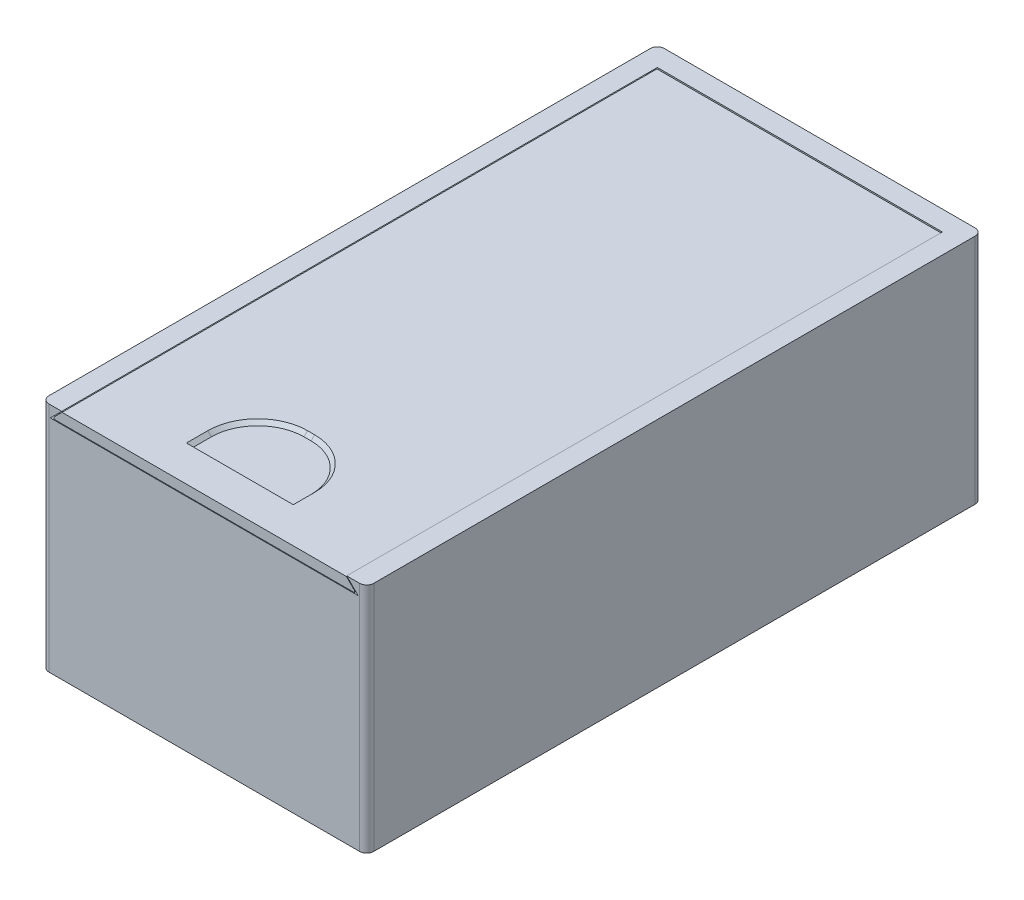
ISO-10303-21;
HEADER;
FILE_DESCRIPTION(('STEP AP214'),'2;1');
FILE_NAME('part.step','',(''),(''),'','','');
FILE_SCHEMA(('AUTOMOTIVE_DESIGN { 1 0 10303 214 1 1 1 1 }'));
ENDSEC;
DATA;
#1=APPLICATION_CONTEXT('core data for automotive mechanical design processes');
#2=APPLICATION_PROTOCOL_DEFINITION('international standard','automotive_design',2000,#1);
#3=PRODUCT_CONTEXT('',#1,'mechanical');
#4=PRODUCT('Part','Part','',(#3));
#5=PRODUCT_RELATED_PRODUCT_CATEGORY('part','',(#4));
#6=PRODUCT_DEFINITION_FORMATION('','',#4);
#7=PRODUCT_DEFINITION_CONTEXT('part definition',#1,'design');
#8=PRODUCT_DEFINITION('design','',#6,#7);
#9=PRODUCT_DEFINITION_SHAPE('','',#8);
#10=(LENGTH_UNIT() NAMED_UNIT(*) SI_UNIT(.MILLI.,.METRE.));
#11=(NAMED_UNIT(*) PLANE_ANGLE_UNIT() SI_UNIT($,.RADIAN.));
#12=(NAMED_UNIT(*) SI_UNIT($,.STERADIAN.) SOLID_ANGLE_UNIT());
#13=UNCERTAINTY_MEASURE_WITH_UNIT(LENGTH_MEASURE(1.E-05),#10,'distance_accuracy_value','');
#14=(GEOMETRIC_REPRESENTATION_CONTEXT(3) GLOBAL_UNCERTAINTY_ASSIGNED_CONTEXT((#13)) GLOBAL_UNIT_ASSIGNED_CONTEXT((#10,
#11,#12)) REPRESENTATION_CONTEXT('',''));
#15=CARTESIAN_POINT('',(0.,0.,0.));
#16=DIRECTION('',(0.,0.,1.));
#17=DIRECTION('',(1.,0.,0.));
#18=AXIS2_PLACEMENT_3D('',#15,#16,#17);
#19=CARTESIAN_POINT('',(0.,0.,2.9));
#20=DIRECTION('',(0.,0.,-1.));
#21=DIRECTION('',(-1.,0.,0.));
#22=AXIS2_PLACEMENT_3D('',#19,#20,#21);
#23=PLANE('',#22);
#24=DIRECTION('',(0.,1.,0.));
#25=VECTOR('',#24,1.);
#26=CARTESIAN_POINT('',(-21.0585786437627,15.1,2.9));
#27=LINE('',#26,#25);
#28=CARTESIAN_POINT('',(-21.0585786437627,14.8,2.9));
#29=VERTEX_POINT('',#28);
#30=CARTESIAN_POINT('',(-21.0585786437627,15.1,2.9));
#31=VERTEX_POINT('',#30);
#32=EDGE_CURVE('E66',#29,#31,#27,.T.);
#33=ORIENTED_EDGE('',*,*,#32,.T.);
#34=DIRECTION('',(-0.707106781186547,-0.707106781186548,0.));
#35=VECTOR('',#34,1.);
#36=CARTESIAN_POINT('',(-19.9585786437627,16.2,2.9));
#37=LINE('',#36,#35);
#38=CARTESIAN_POINT('',(-19.9585786437627,16.2,2.9));
#39=VERTEX_POINT('',#38);
#40=EDGE_CURVE('E150',#39,#31,#37,.T.);
#41=ORIENTED_EDGE('',*,*,#40,.F.);
#42=DIRECTION('',(-1.,0.,0.));
#43=VECTOR('',#42,1.);
#44=CARTESIAN_POINT('',(19.9585786437627,16.2,2.9));
#45=LINE('',#44,#43);
#46=CARTESIAN_POINT('',(19.9585786437627,16.2,2.9));
#47=VERTEX_POINT('',#46);
#48=EDGE_CURVE('E161',#47,#39,#45,.T.);
#49=ORIENTED_EDGE('',*,*,#48,.F.);
#50=DIRECTION('',(-0.707106781186546,0.707106781186549,0.));
#51=VECTOR('',#50,1.);
#52=CARTESIAN_POINT('',(21.3585786437627,14.8,2.9));
#53=LINE('',#52,#51);
#54=CARTESIAN_POINT('',(21.0585786437627,15.1,2.9));
#55=VERTEX_POINT('',#54);
#56=EDGE_CURVE('E159',#55,#47,#53,.T.);
#57=ORIENTED_EDGE('',*,*,#56,.F.);
#58=DIRECTION('',(0.,-1.,0.));
#59=VECTOR('',#58,1.);
#60=CARTESIAN_POINT('',(21.0585786437627,15.0999999999999,2.9));
#61=LINE('',#60,#59);
#62=CARTESIAN_POINT('',(21.0585786437627,14.7999999999999,2.9));
#63=VERTEX_POINT('',#62);
#64=EDGE_CURVE('E74',#55,#63,#61,.T.);
#65=ORIENTED_EDGE('',*,*,#64,.T.);
#66=DIRECTION('',(1.,0.,0.));
#67=VECTOR('',#66,1.);
#68=CARTESIAN_POINT('',(-21.3585786437627,14.8,2.9));
#69=LINE('',#68,#67);
#70=EDGE_CURVE('E153',#29,#63,#69,.T.);
#71=ORIENTED_EDGE('',*,*,#70,.F.);
#72=EDGE_LOOP('',(#33,#41,#49,#57,#65,#71));
#73=FACE_BOUND('',#72,.T.);
#74=ADVANCED_FACE('F49',(#73),#23,.T.);
#75=CARTESIAN_POINT('',(0.,0.,86.4));
#76=DIRECTION('',(0.,0.,1.));
#77=DIRECTION('',(1.,0.,0.));
#78=AXIS2_PLACEMENT_3D('',#75,#76,#77);
#79=PLANE('',#78);
#80=DIRECTION('',(0.,1.,0.));
#81=VECTOR('',#80,1.);
#82=CARTESIAN_POINT('',(-21.0585786437627,15.1,86.4));
#83=LINE('',#82,#81);
#84=CARTESIAN_POINT('',(-21.0585786437627,14.8,86.4));
#85=VERTEX_POINT('',#84);
#86=CARTESIAN_POINT('',(-21.0585786437627,15.1,86.4));
#87=VERTEX_POINT('',#86);
#88=EDGE_CURVE('E140',#85,#87,#83,.T.);
#89=ORIENTED_EDGE('',*,*,#88,.F.);
#90=DIRECTION('',(1.,0.,0.));
#91=VECTOR('',#90,1.);
#92=CARTESIAN_POINT('',(-21.3585786437627,14.8,86.4));
#93=LINE('',#92,#91);
#94=CARTESIAN_POINT('',(21.0585786437627,14.7999999999999,86.4));
#95=VERTEX_POINT('',#94);
#96=EDGE_CURVE('E217',#85,#95,#93,.T.);
#97=ORIENTED_EDGE('',*,*,#96,.T.);
#98=DIRECTION('',(0.,-1.,0.));
#99=VECTOR('',#98,1.);
#100=CARTESIAN_POINT('',(21.0585786437627,15.0999999999999,86.4));
#101=LINE('',#100,#99);
#102=CARTESIAN_POINT('',(21.0585786437627,15.0999999999999,86.4));
#103=VERTEX_POINT('',#102);
#104=EDGE_CURVE('E239',#103,#95,#101,.T.);
#105=ORIENTED_EDGE('',*,*,#104,.F.);
#106=DIRECTION('',(-0.707106781186546,0.707106781186549,0.));
#107=VECTOR('',#106,1.);
#108=CARTESIAN_POINT('',(21.3585786437627,14.8,86.4));
#109=LINE('',#108,#107);
#110=CARTESIAN_POINT('',(19.9585786437627,16.2,86.4));
#111=VERTEX_POINT('',#110);
#112=EDGE_CURVE('E225',#103,#111,#109,.T.);
#113=ORIENTED_EDGE('',*,*,#112,.T.);
#114=DIRECTION('',(-1.,0.,0.));
#115=VECTOR('',#114,1.);
#116=CARTESIAN_POINT('',(19.9585786437627,16.2,86.4));
#117=LINE('',#116,#115);
#118=CARTESIAN_POINT('',(-19.9585786437627,16.2,86.4));
#119=VERTEX_POINT('',#118);
#120=EDGE_CURVE('E222',#111,#119,#117,.T.);
#121=ORIENTED_EDGE('',*,*,#120,.T.);
#122=DIRECTION('',(-0.707106781186547,-0.707106781186548,0.));
#123=VECTOR('',#122,1.);
#124=CARTESIAN_POINT('',(-19.9585786437627,16.2,86.4));
#125=LINE('',#124,#123);
#126=EDGE_CURVE('E220',#119,#87,#125,.T.);
#127=ORIENTED_EDGE('',*,*,#126,.T.);
#128=EDGE_LOOP('',(#89,#97,#105,#113,#121,#127));
#129=FACE_BOUND('',#128,.T.);
#130=ADVANCED_FACE('F237',(#129),#79,.T.);
#131=CARTESIAN_POINT('',(19.9585786437627,16.2,-39.9400927318505));
#132=DIRECTION('',(0.,1.,0.));
#133=DIRECTION('',(0.,0.,1.));
#134=AXIS2_PLACEMENT_3D('',#131,#132,#133);
#135=PLANE('',#134);
#136=DIRECTION('',(0.,0.,-1.));
#137=VECTOR('',#136,1.);
#138=CARTESIAN_POINT('',(7.50000000000002,16.2,81.4));
#139=LINE('',#138,#137);
#140=CARTESIAN_POINT('',(7.50000000000002,16.2,81.4));
#141=VERTEX_POINT('',#140);
#142=CARTESIAN_POINT('',(7.50000000000002,16.2,78.4));
#143=VERTEX_POINT('',#142);
#144=EDGE_CURVE('E195',#141,#143,#139,.T.);
#145=ORIENTED_EDGE('',*,*,#144,.F.);
#146=DIRECTION('',(1.,0.,0.));
#147=VECTOR('',#146,1.);
#148=CARTESIAN_POINT('',(-7.49999999999998,16.2,81.4));
#149=LINE('',#148,#147);
#150=CARTESIAN_POINT('',(-7.49999999999998,16.2,81.4));
#151=VERTEX_POINT('',#150);
#152=EDGE_CURVE('E215',#151,#141,#149,.T.);
#153=ORIENTED_EDGE('',*,*,#152,.F.);
#154=DIRECTION('',(0.,0.,1.));
#155=VECTOR('',#154,1.);
#156=CARTESIAN_POINT('',(-7.49999999999998,16.2,81.4));
#157=LINE('',#156,#155);
#158=CARTESIAN_POINT('',(-7.49999999999998,16.2,78.4));
#159=VERTEX_POINT('',#158);
#160=EDGE_CURVE('E207',#159,#151,#157,.T.);
#161=ORIENTED_EDGE('',*,*,#160,.F.);
#162=CARTESIAN_POINT('',(-0.499999999999976,16.2,78.4));
#163=DIRECTION('',(0.,1.,0.));
#164=DIRECTION('',(0.,0.,1.));
#165=AXIS2_PLACEMENT_3D('',#162,#163,#164);
#166=CIRCLE('',#165,7.);
#167=CARTESIAN_POINT('',(-0.499999999999976,16.2,71.4));
#168=VERTEX_POINT('',#167);
#169=EDGE_CURVE('E168',#159,#168,#166,.F.);
#170=ORIENTED_EDGE('',*,*,#169,.T.);
#171=DIRECTION('',(-1.,0.,0.));
#172=VECTOR('',#171,1.);
#173=CARTESIAN_POINT('',(-7.49999999999998,16.2,71.4));
#174=LINE('',#173,#172);
#175=CARTESIAN_POINT('',(0.500000000000024,16.2,71.4));
#176=VERTEX_POINT('',#175);
#177=EDGE_CURVE('E201',#176,#168,#174,.T.);
#178=ORIENTED_EDGE('',*,*,#177,.F.);
#179=CARTESIAN_POINT('',(0.500000000000024,16.2,78.4));
#180=DIRECTION('',(0.,1.,0.));
#181=DIRECTION('',(0.,0.,1.));
#182=AXIS2_PLACEMENT_3D('',#179,#180,#181);
#183=CIRCLE('',#182,7.);
#184=EDGE_CURVE('E170',#176,#143,#183,.F.);
#185=ORIENTED_EDGE('',*,*,#184,.T.);
#186=EDGE_LOOP('',(#145,#153,#161,#170,#178,#185));
#187=FACE_BOUND('',#186,.T.);
#188=DIRECTION('',(0.,0.,1.));
#189=VECTOR('',#188,1.);
#190=CARTESIAN_POINT('',(19.9585786437627,16.2,-39.9400927318505));
#191=LINE('',#190,#189);
#192=EDGE_CURVE('E165',#47,#111,#191,.T.);
#193=ORIENTED_EDGE('',*,*,#192,.F.);
#194=ORIENTED_EDGE('',*,*,#48,.T.);
#195=DIRECTION('',(0.,0.,1.));
#196=VECTOR('',#195,1.);
#197=CARTESIAN_POINT('',(-19.9585786437627,16.2,-39.9400927318505));
#198=LINE('',#197,#196);
#199=EDGE_CURVE('E156',#39,#119,#198,.T.);
#200=ORIENTED_EDGE('',*,*,#199,.T.);
#201=ORIENTED_EDGE('',*,*,#120,.F.);
#202=EDGE_LOOP('',(#193,#194,#200,#201));
#203=FACE_BOUND('',#202,.T.);
#204=ADVANCED_FACE('F235',(#187,#203),#135,.T.);
#205=CARTESIAN_POINT('',(-19.9585786437627,16.2,-39.9400927318505));
#206=DIRECTION('',(-0.707106781186548,0.707106781186547,0.));
#207=DIRECTION('',(-0.707106781186547,-0.707106781186548,0.));
#208=AXIS2_PLACEMENT_3D('',#205,#206,#207);
#209=PLANE('',#208);
#210=DIRECTION('',(0.,0.,1.));
#211=VECTOR('',#210,1.);
#212=CARTESIAN_POINT('',(-21.0585786437627,15.1,2.47573593128807));
#213=LINE('',#212,#211);
#214=EDGE_CURVE('E137',#31,#87,#213,.T.);
#215=ORIENTED_EDGE('',*,*,#214,.T.);
#216=ORIENTED_EDGE('',*,*,#126,.F.);
#217=ORIENTED_EDGE('',*,*,#199,.F.);
#218=ORIENTED_EDGE('',*,*,#40,.T.);
#219=EDGE_LOOP('',(#215,#216,#217,#218));
#220=FACE_BOUND('',#219,.T.);
#221=ADVANCED_FACE('F155',(#220),#209,.T.);
#222=CARTESIAN_POINT('',(-21.3585786437627,14.8,-39.9400927318505));
#223=DIRECTION('',(0.,-1.,0.));
#224=DIRECTION('',(1.,0.,0.));
#225=AXIS2_PLACEMENT_3D('',#222,#223,#224);
#226=PLANE('',#225);
#227=DIRECTION('',(0.,0.,1.));
#228=VECTOR('',#227,1.);
#229=CARTESIAN_POINT('',(-21.0585786437627,14.8,2.47573593128807));
#230=LINE('',#229,#228);
#231=EDGE_CURVE('E145',#29,#85,#230,.T.);
#232=ORIENTED_EDGE('',*,*,#231,.F.);
#233=ORIENTED_EDGE('',*,*,#70,.T.);
#234=DIRECTION('',(0.,0.,1.));
#235=VECTOR('',#234,1.);
#236=CARTESIAN_POINT('',(21.0585786437627,14.7999999999999,2.47573593128807));
#237=LINE('',#236,#235);
#238=EDGE_CURVE('E243',#63,#95,#237,.T.);
#239=ORIENTED_EDGE('',*,*,#238,.T.);
#240=ORIENTED_EDGE('',*,*,#96,.F.);
#241=EDGE_LOOP('',(#232,#233,#239,#240));
#242=FACE_BOUND('',#241,.T.);
#243=ADVANCED_FACE('F304',(#242),#226,.T.);
#244=CARTESIAN_POINT('',(21.3585786437627,14.8,-39.9400927318505));
#245=DIRECTION('',(0.707106781186549,0.707106781186546,0.));
#246=DIRECTION('',(-0.707106781186546,0.707106781186549,0.));
#247=AXIS2_PLACEMENT_3D('',#244,#245,#246);
#248=PLANE('',#247);
#249=DIRECTION('',(0.,0.,1.));
#250=VECTOR('',#249,1.);
#251=CARTESIAN_POINT('',(21.0585786437627,15.0999999999999,2.47573593128807));
#252=LINE('',#251,#250);
#253=EDGE_CURVE('E233',#55,#103,#252,.T.);
#254=ORIENTED_EDGE('',*,*,#253,.F.);
#255=ORIENTED_EDGE('',*,*,#56,.T.);
#256=ORIENTED_EDGE('',*,*,#192,.T.);
#257=ORIENTED_EDGE('',*,*,#112,.F.);
#258=EDGE_LOOP('',(#254,#255,#256,#257));
#259=FACE_BOUND('',#258,.T.);
#260=ADVANCED_FACE('F229',(#259),#248,.T.);
#261=CARTESIAN_POINT('',(-7.49999999999998,15.7,81.4));
#262=DIRECTION('',(0.,0.,1.));
#263=DIRECTION('',(1.,0.,0.));
#264=AXIS2_PLACEMENT_3D('',#261,#262,#263);
#265=PLANE('',#264);
#266=ORIENTED_EDGE('',*,*,#152,.T.);
#267=DIRECTION('',(0.707106781186558,0.707106781186537,0.));
#268=VECTOR('',#267,1.);
#269=CARTESIAN_POINT('',(7.00000000000003,15.7,81.4));
#270=LINE('',#269,#268);
#271=CARTESIAN_POINT('',(7.00000000000003,15.7,81.4));
#272=VERTEX_POINT('',#271);
#273=EDGE_CURVE('E13',#141,#272,#270,.F.);
#274=ORIENTED_EDGE('',*,*,#273,.T.);
#275=DIRECTION('',(1.,0.,0.));
#276=VECTOR('',#275,1.);
#277=CARTESIAN_POINT('',(-7.49999999999998,15.7,81.4));
#278=LINE('',#277,#276);
#279=CARTESIAN_POINT('',(-6.99999999999998,15.7,81.4));
#280=VERTEX_POINT('',#279);
#281=EDGE_CURVE('E210',#280,#272,#278,.T.);
#282=ORIENTED_EDGE('',*,*,#281,.F.);
#283=DIRECTION('',(0.707106781186558,-0.707106781186537,0.));
#284=VECTOR('',#283,1.);
#285=CARTESIAN_POINT('',(-6.99999999999998,15.7,81.4));
#286=LINE('',#285,#284);
#287=EDGE_CURVE('E58',#280,#151,#286,.F.);
#288=ORIENTED_EDGE('',*,*,#287,.T.);
#289=EDGE_LOOP('',(#266,#274,#282,#288));
#290=FACE_BOUND('',#289,.T.);
#291=ADVANCED_FACE('F285',(#290),#265,.F.);
#292=CARTESIAN_POINT('',(0.,15.7,0.));
#293=DIRECTION('',(0.,-1.,0.));
#294=DIRECTION('',(0.,0.,-1.));
#295=AXIS2_PLACEMENT_3D('',#292,#293,#294);
#296=PLANE('',#295);
#297=ORIENTED_EDGE('',*,*,#281,.T.);
#298=DIRECTION('',(0.,0.,-1.));
#299=VECTOR('',#298,1.);
#300=CARTESIAN_POINT('',(7.00000000000003,15.7,78.4));
#301=LINE('',#300,#299);
#302=CARTESIAN_POINT('',(7.00000000000003,15.7,78.4));
#303=VERTEX_POINT('',#302);
#304=EDGE_CURVE('E180',#272,#303,#301,.T.);
#305=ORIENTED_EDGE('',*,*,#304,.T.);
#306=CARTESIAN_POINT('',(0.500000000000024,15.7,78.4));
#307=DIRECTION('',(0.,-1.,0.));
#308=DIRECTION('',(0.,0.,-1.));
#309=AXIS2_PLACEMENT_3D('',#306,#307,#308);
#310=CIRCLE('',#309,6.50000000000001);
#311=CARTESIAN_POINT('',(0.500000000000024,15.7,71.9));
#312=VERTEX_POINT('',#311);
#313=EDGE_CURVE('E178',#303,#312,#310,.F.);
#314=ORIENTED_EDGE('',*,*,#313,.T.);
#315=DIRECTION('',(-1.,0.,0.));
#316=VECTOR('',#315,1.);
#317=CARTESIAN_POINT('',(-0.499999999999976,15.7,71.9));
#318=LINE('',#317,#316);
#319=CARTESIAN_POINT('',(-0.499999999999976,15.7,71.9));
#320=VERTEX_POINT('',#319);
#321=EDGE_CURVE('E176',#312,#320,#318,.T.);
#322=ORIENTED_EDGE('',*,*,#321,.T.);
#323=CARTESIAN_POINT('',(-0.499999999999976,15.7,78.4));
#324=DIRECTION('',(0.,-1.,0.));
#325=DIRECTION('',(0.,0.,-1.));
#326=AXIS2_PLACEMENT_3D('',#323,#324,#325);
#327=CIRCLE('',#326,6.50000000000001);
#328=CARTESIAN_POINT('',(-6.99999999999998,15.7,78.4));
#329=VERTEX_POINT('',#328);
#330=EDGE_CURVE('E172',#320,#329,#327,.F.);
#331=ORIENTED_EDGE('',*,*,#330,.T.);
#332=DIRECTION('',(0.,0.,1.));
#333=VECTOR('',#332,1.);
#334=CARTESIAN_POINT('',(-6.99999999999998,15.7,81.4));
#335=LINE('',#334,#333);
#336=EDGE_CURVE('E174',#329,#280,#335,.T.);
#337=ORIENTED_EDGE('',*,*,#336,.T.);
#338=EDGE_LOOP('',(#297,#305,#314,#322,#331,#337));
#339=FACE_BOUND('',#338,.T.);
#340=ADVANCED_FACE('F280',(#339),#296,.F.);
#341=CARTESIAN_POINT('',(-6.99999999999998,15.7,0.));
#342=DIRECTION('',(0.707106781186537,0.707106781186558,0.));
#343=DIRECTION('',(0.,0.,-1.));
#344=AXIS2_PLACEMENT_3D('',#341,#342,#343);
#345=PLANE('',#344);
#346=ORIENTED_EDGE('',*,*,#287,.F.);
#347=ORIENTED_EDGE('',*,*,#336,.F.);
#348=DIRECTION('',(0.707106781186558,-0.707106781186537,0.));
#349=VECTOR('',#348,1.);
#350=CARTESIAN_POINT('',(-7.49999999999998,16.2,78.4));
#351=LINE('',#350,#349);
#352=EDGE_CURVE('E53',#159,#329,#351,.T.);
#353=ORIENTED_EDGE('',*,*,#352,.F.);
#354=ORIENTED_EDGE('',*,*,#160,.T.);
#355=EDGE_LOOP('',(#346,#347,#353,#354));
#356=FACE_BOUND('',#355,.T.);
#357=ADVANCED_FACE('F51',(#356),#345,.T.);
#358=CARTESIAN_POINT('',(-0.499999999999976,15.7,78.4));
#359=DIRECTION('',(0.,1.,0.));
#360=DIRECTION('',(0.,0.,1.));
#361=AXIS2_PLACEMENT_3D('',#358,#359,#360);
#362=CONICAL_SURFACE('',#361,6.50000000000001,0.785398163397463);
#363=ORIENTED_EDGE('',*,*,#352,.T.);
#364=ORIENTED_EDGE('',*,*,#330,.F.);
#365=DIRECTION('',(0.,-0.707106781186533,0.707106781186562));
#366=VECTOR('',#365,1.);
#367=CARTESIAN_POINT('',(-0.499999999999976,16.2,71.4));
#368=LINE('',#367,#366);
#369=EDGE_CURVE('E188',#168,#320,#368,.T.);
#370=ORIENTED_EDGE('',*,*,#369,.F.);
#371=ORIENTED_EDGE('',*,*,#169,.F.);
#372=EDGE_LOOP('',(#363,#364,#370,#371));
#373=FACE_BOUND('',#372,.T.);
#374=ADVANCED_FACE('F275',(#373),#362,.F.);
#375=CARTESIAN_POINT('',(0.,15.7,71.9));
#376=DIRECTION('',(0.,0.707106781186562,0.707106781186533));
#377=DIRECTION('',(1.,0.,0.));
#378=AXIS2_PLACEMENT_3D('',#375,#376,#377);
#379=PLANE('',#378);
#380=ORIENTED_EDGE('',*,*,#369,.T.);
#381=ORIENTED_EDGE('',*,*,#321,.F.);
#382=DIRECTION('',(0.,-0.707106781186533,0.707106781186562));
#383=VECTOR('',#382,1.);
#384=CARTESIAN_POINT('',(0.500000000000024,16.2,71.4));
#385=LINE('',#384,#383);
#386=EDGE_CURVE('E186',#176,#312,#385,.T.);
#387=ORIENTED_EDGE('',*,*,#386,.F.);
#388=ORIENTED_EDGE('',*,*,#177,.T.);
#389=EDGE_LOOP('',(#380,#381,#387,#388));
#390=FACE_BOUND('',#389,.T.);
#391=ADVANCED_FACE('F272',(#390),#379,.T.);
#392=CARTESIAN_POINT('',(0.500000000000024,15.7,78.4));
#393=DIRECTION('',(0.,1.,0.));
#394=DIRECTION('',(0.,0.,1.));
#395=AXIS2_PLACEMENT_3D('',#392,#393,#394);
#396=CONICAL_SURFACE('',#395,6.50000000000001,0.785398163397463);
#397=ORIENTED_EDGE('',*,*,#386,.T.);
#398=ORIENTED_EDGE('',*,*,#313,.F.);
#399=DIRECTION('',(-0.707106781186558,-0.707106781186537,0.));
#400=VECTOR('',#399,1.);
#401=CARTESIAN_POINT('',(7.50000000000002,16.2,78.4));
#402=LINE('',#401,#400);
#403=EDGE_CURVE('E184',#143,#303,#402,.T.);
#404=ORIENTED_EDGE('',*,*,#403,.F.);
#405=ORIENTED_EDGE('',*,*,#184,.F.);
#406=EDGE_LOOP('',(#397,#398,#404,#405));
#407=FACE_BOUND('',#406,.T.);
#408=ADVANCED_FACE('F257',(#407),#396,.F.);
#409=CARTESIAN_POINT('',(7.00000000000003,15.7,0.));
#410=DIRECTION('',(-0.707106781186537,0.707106781186558,0.));
#411=DIRECTION('',(0.,0.,1.));
#412=AXIS2_PLACEMENT_3D('',#409,#410,#411);
#413=PLANE('',#412);
#414=ORIENTED_EDGE('',*,*,#273,.F.);
#415=ORIENTED_EDGE('',*,*,#144,.T.);
#416=ORIENTED_EDGE('',*,*,#403,.T.);
#417=ORIENTED_EDGE('',*,*,#304,.F.);
#418=EDGE_LOOP('',(#414,#415,#416,#417));
#419=FACE_BOUND('',#418,.T.);
#420=ADVANCED_FACE('F250',(#419),#413,.T.);
#421=CARTESIAN_POINT('',(21.0585786437627,15.0999999999999,2.47573593128807));
#422=DIRECTION('',(-1.,0.,0.));
#423=DIRECTION('',(0.,0.,1.));
#424=AXIS2_PLACEMENT_3D('',#421,#422,#423);
#425=PLANE('',#424);
#426=ORIENTED_EDGE('',*,*,#253,.T.);
#427=ORIENTED_EDGE('',*,*,#104,.T.);
#428=ORIENTED_EDGE('',*,*,#238,.F.);
#429=ORIENTED_EDGE('',*,*,#64,.F.);
#430=EDGE_LOOP('',(#426,#427,#428,#429));
#431=FACE_BOUND('',#430,.T.);
#432=ADVANCED_FACE('F248',(#431),#425,.F.);
#433=CARTESIAN_POINT('',(-21.0585786437627,15.1,2.47573593128807));
#434=DIRECTION('',(1.,0.,0.));
#435=DIRECTION('',(0.,0.,-1.));
#436=AXIS2_PLACEMENT_3D('',#433,#434,#435);
#437=PLANE('',#436);
#438=ORIENTED_EDGE('',*,*,#231,.T.);
#439=ORIENTED_EDGE('',*,*,#88,.T.);
#440=ORIENTED_EDGE('',*,*,#214,.F.);
#441=ORIENTED_EDGE('',*,*,#32,.F.);
#442=EDGE_LOOP('',(#438,#439,#440,#441));
#443=FACE_BOUND('',#442,.T.);
#444=ADVANCED_FACE('F138',(#443),#437,.F.);
#445=CLOSED_SHELL('',(#74,#130,#204,#221,#243,#260,#291,#340,#357,#374,#391,#408,#420,#432,#444));
#446=MANIFOLD_SOLID_BREP('B2',#445);
#447=CARTESIAN_POINT('',(-22.8,16.3,86.4));
#448=DIRECTION('',(0.,-1.,0.));
#449=DIRECTION('',(0.,0.,-1.));
#450=AXIS2_PLACEMENT_3D('',#447,#448,#449);
#451=PLANE('',#450);
#452=DIRECTION('',(-1.,0.,0.));
#453=VECTOR('',#452,1.);
#454=CARTESIAN_POINT('',(-22.8,16.3,0.));
#455=LINE('',#454,#453);
#456=CARTESIAN_POINT('',(21.8,16.3,0.));
#457=VERTEX_POINT('',#456);
#458=CARTESIAN_POINT('',(-21.8,16.3,0.));
#459=VERTEX_POINT('',#458);
#460=EDGE_CURVE('E537',#457,#459,#455,.T.);
#461=ORIENTED_EDGE('',*,*,#460,.T.);
#462=CARTESIAN_POINT('',(-21.8,16.3,1.));
#463=DIRECTION('',(0.,-1.,0.));
#464=DIRECTION('',(0.,0.,-1.));
#465=AXIS2_PLACEMENT_3D('',#462,#463,#464);
#466=CIRCLE('',#465,1.);
#467=CARTESIAN_POINT('',(-22.8,16.3,1.00000000000003));
#468=VERTEX_POINT('',#467);
#469=EDGE_CURVE('E584',#459,#468,#466,.F.);
#470=ORIENTED_EDGE('',*,*,#469,.T.);
#471=DIRECTION('',(0.,0.,-1.));
#472=VECTOR('',#471,1.);
#473=CARTESIAN_POINT('',(-22.8,16.3,86.4));
#474=LINE('',#473,#472);
#475=CARTESIAN_POINT('',(-22.8,16.3,85.4));
#476=VERTEX_POINT('',#475);
#477=EDGE_CURVE('E558',#476,#468,#474,.T.);
#478=ORIENTED_EDGE('',*,*,#477,.F.);
#479=CARTESIAN_POINT('',(-21.8,16.3,85.4));
#480=DIRECTION('',(0.,-1.,0.));
#481=DIRECTION('',(0.,0.,-1.));
#482=AXIS2_PLACEMENT_3D('',#479,#480,#481);
#483=CIRCLE('',#482,1.);
#484=CARTESIAN_POINT('',(-21.8,16.3,86.4));
#485=VERTEX_POINT('',#484);
#486=EDGE_CURVE('E581',#476,#485,#483,.F.);
#487=ORIENTED_EDGE('',*,*,#486,.T.);
#488=DIRECTION('',(-1.,0.,0.));
#489=VECTOR('',#488,1.);
#490=CARTESIAN_POINT('',(-22.8,16.3,86.4));
#491=LINE('',#490,#489);
#492=CARTESIAN_POINT('',(-20.,16.3,86.4));
#493=VERTEX_POINT('',#492);
#494=EDGE_CURVE('E533',#493,#485,#491,.T.);
#495=ORIENTED_EDGE('',*,*,#494,.F.);
#496=DIRECTION('',(0.,0.,-1.));
#497=VECTOR('',#496,1.);
#498=CARTESIAN_POINT('',(-20.,16.3,86.4));
#499=LINE('',#498,#497);
#500=CARTESIAN_POINT('',(-20.,16.3,2.8));
#501=VERTEX_POINT('',#500);
#502=EDGE_CURVE('E512',#493,#501,#499,.T.);
#503=ORIENTED_EDGE('',*,*,#502,.T.);
#504=DIRECTION('',(-1.,0.,0.));
#505=VECTOR('',#504,1.);
#506=CARTESIAN_POINT('',(0.,16.3,2.8));
#507=LINE('',#506,#505);
#508=CARTESIAN_POINT('',(20.,16.3,2.8));
#509=VERTEX_POINT('',#508);
#510=EDGE_CURVE('E520',#509,#501,#507,.T.);
#511=ORIENTED_EDGE('',*,*,#510,.F.);
#512=DIRECTION('',(0.,0.,-1.));
#513=VECTOR('',#512,1.);
#514=CARTESIAN_POINT('',(20.,16.3,86.4));
#515=LINE('',#514,#513);
#516=CARTESIAN_POINT('',(20.,16.3,86.4));
#517=VERTEX_POINT('',#516);
#518=EDGE_CURVE('E534',#517,#509,#515,.T.);
#519=ORIENTED_EDGE('',*,*,#518,.F.);
#520=CARTESIAN_POINT('',(21.8,16.3,86.4));
#521=VERTEX_POINT('',#520);
#522=EDGE_CURVE('E543',#521,#517,#491,.T.);
#523=ORIENTED_EDGE('',*,*,#522,.F.);
#524=CARTESIAN_POINT('',(21.8,16.3,85.4));
#525=DIRECTION('',(0.,-1.,0.));
#526=DIRECTION('',(0.,0.,-1.));
#527=AXIS2_PLACEMENT_3D('',#524,#525,#526);
#528=CIRCLE('',#527,1.);
#529=CARTESIAN_POINT('',(22.8,16.3,85.4));
#530=VERTEX_POINT('',#529);
#531=EDGE_CURVE('E415',#521,#530,#528,.F.);
#532=ORIENTED_EDGE('',*,*,#531,.T.);
#533=DIRECTION('',(0.,0.,-1.));
#534=VECTOR('',#533,1.);
#535=CARTESIAN_POINT('',(22.8,16.3,86.4));
#536=LINE('',#535,#534);
#537=CARTESIAN_POINT('',(22.8,16.3,1.00000000000003));
#538=VERTEX_POINT('',#537);
#539=EDGE_CURVE('E561',#530,#538,#536,.T.);
#540=ORIENTED_EDGE('',*,*,#539,.T.);
#541=CARTESIAN_POINT('',(21.8,16.3,1.));
#542=DIRECTION('',(0.,-1.,0.));
#543=DIRECTION('',(0.,0.,-1.));
#544=AXIS2_PLACEMENT_3D('',#541,#542,#543);
#545=CIRCLE('',#544,1.);
#546=EDGE_CURVE('E407',#538,#457,#545,.F.);
#547=ORIENTED_EDGE('',*,*,#546,.T.);
#548=EDGE_LOOP('',(#461,#470,#478,#487,#495,#503,#511,#519,#523,#532,#540,#547));
#549=FACE_BOUND('',#548,.T.);
#550=ADVANCED_FACE('F392',(#549),#451,.F.);
#551=CARTESIAN_POINT('',(22.8,-16.3,86.4));
#552=DIRECTION('',(-1.,0.,0.));
#553=DIRECTION('',(0.,0.,1.));
#554=AXIS2_PLACEMENT_3D('',#551,#552,#553);
#555=PLANE('',#554);
#556=DIRECTION('',(0.,0.,-1.));
#557=VECTOR('',#556,1.);
#558=CARTESIAN_POINT('',(22.8,-16.3,86.4));
#559=LINE('',#558,#557);
#560=CARTESIAN_POINT('',(22.8,-16.3,85.4));
#561=VERTEX_POINT('',#560);
#562=CARTESIAN_POINT('',(22.8,-16.3,1.00000000000003));
#563=VERTEX_POINT('',#562);
#564=EDGE_CURVE('E548',#561,#563,#559,.T.);
#565=ORIENTED_EDGE('',*,*,#564,.T.);
#566=DIRECTION('',(0.,1.,0.));
#567=VECTOR('',#566,1.);
#568=CARTESIAN_POINT('',(22.8,16.3,1.));
#569=LINE('',#568,#567);
#570=EDGE_CURVE('E588',#563,#538,#569,.T.);
#571=ORIENTED_EDGE('',*,*,#570,.T.);
#572=ORIENTED_EDGE('',*,*,#539,.F.);
#573=DIRECTION('',(0.,1.,0.));
#574=VECTOR('',#573,1.);
#575=CARTESIAN_POINT('',(22.8,-16.3,85.4));
#576=LINE('',#575,#574);
#577=EDGE_CURVE('E586',#530,#561,#576,.F.);
#578=ORIENTED_EDGE('',*,*,#577,.T.);
#579=EDGE_LOOP('',(#565,#571,#572,#578));
#580=FACE_BOUND('',#579,.T.);
#581=ADVANCED_FACE('F679',(#580),#555,.F.);
#582=CARTESIAN_POINT('',(-22.8,-16.3,86.4));
#583=DIRECTION('',(1.,0.,0.));
#584=DIRECTION('',(0.,0.,-1.));
#585=AXIS2_PLACEMENT_3D('',#582,#583,#584);
#586=PLANE('',#585);
#587=ORIENTED_EDGE('',*,*,#477,.T.);
#588=DIRECTION('',(0.,-1.,0.));
#589=VECTOR('',#588,1.);
#590=CARTESIAN_POINT('',(-22.8,-16.3,1.));
#591=LINE('',#590,#589);
#592=CARTESIAN_POINT('',(-22.8,-16.3,1.00000000000003));
#593=VERTEX_POINT('',#592);
#594=EDGE_CURVE('E565',#468,#593,#591,.T.);
#595=ORIENTED_EDGE('',*,*,#594,.T.);
#596=DIRECTION('',(0.,0.,-1.));
#597=VECTOR('',#596,1.);
#598=CARTESIAN_POINT('',(-22.8,-16.3,86.4));
#599=LINE('',#598,#597);
#600=CARTESIAN_POINT('',(-22.8,-16.3,85.4));
#601=VERTEX_POINT('',#600);
#602=EDGE_CURVE('E555',#601,#593,#599,.T.);
#603=ORIENTED_EDGE('',*,*,#602,.F.);
#604=DIRECTION('',(0.,-1.,0.));
#605=VECTOR('',#604,1.);
#606=CARTESIAN_POINT('',(-22.8,-16.3,85.4));
#607=LINE('',#606,#605);
#608=EDGE_CURVE('E563',#601,#476,#607,.F.);
#609=ORIENTED_EDGE('',*,*,#608,.T.);
#610=EDGE_LOOP('',(#587,#595,#603,#609));
#611=FACE_BOUND('',#610,.T.);
#612=ADVANCED_FACE('F664',(#611),#586,.F.);
#613=CARTESIAN_POINT('',(-22.8,-16.3,86.4));
#614=DIRECTION('',(0.,1.,0.));
#615=DIRECTION('',(0.,0.,1.));
#616=AXIS2_PLACEMENT_3D('',#613,#614,#615);
#617=PLANE('',#616);
#618=ORIENTED_EDGE('',*,*,#602,.T.);
#619=CARTESIAN_POINT('',(-21.8,-16.3,1.));
#620=DIRECTION('',(0.,1.,0.));
#621=DIRECTION('',(0.,0.,1.));
#622=AXIS2_PLACEMENT_3D('',#619,#620,#621);
#623=CIRCLE('',#622,1.);
#624=CARTESIAN_POINT('',(-21.8,-16.3,0.));
#625=VERTEX_POINT('',#624);
#626=EDGE_CURVE('E574',#593,#625,#623,.F.);
#627=ORIENTED_EDGE('',*,*,#626,.T.);
#628=DIRECTION('',(1.,0.,0.));
#629=VECTOR('',#628,1.);
#630=CARTESIAN_POINT('',(-22.8,-16.3,0.));
#631=LINE('',#630,#629);
#632=CARTESIAN_POINT('',(21.8,-16.3,0.));
#633=VERTEX_POINT('',#632);
#634=EDGE_CURVE('E550',#625,#633,#631,.T.);
#635=ORIENTED_EDGE('',*,*,#634,.T.);
#636=CARTESIAN_POINT('',(21.8,-16.3,1.));
#637=DIRECTION('',(0.,1.,0.));
#638=DIRECTION('',(0.,0.,1.));
#639=AXIS2_PLACEMENT_3D('',#636,#637,#638);
#640=CIRCLE('',#639,1.);
#641=EDGE_CURVE('E572',#633,#563,#640,.F.);
#642=ORIENTED_EDGE('',*,*,#641,.T.);
#643=ORIENTED_EDGE('',*,*,#564,.F.);
#644=CARTESIAN_POINT('',(21.8,-16.3,85.4));
#645=DIRECTION('',(0.,1.,0.));
#646=DIRECTION('',(0.,0.,1.));
#647=AXIS2_PLACEMENT_3D('',#644,#645,#646);
#648=CIRCLE('',#647,1.);
#649=CARTESIAN_POINT('',(21.8,-16.3,86.4));
#650=VERTEX_POINT('',#649);
#651=EDGE_CURVE('E568',#561,#650,#648,.F.);
#652=ORIENTED_EDGE('',*,*,#651,.T.);
#653=DIRECTION('',(1.,0.,0.));
#654=VECTOR('',#653,1.);
#655=CARTESIAN_POINT('',(-22.8,-16.3,86.4));
#656=LINE('',#655,#654);
#657=CARTESIAN_POINT('',(-21.8,-16.3,86.4));
#658=VERTEX_POINT('',#657);
#659=EDGE_CURVE('E545',#658,#650,#656,.T.);
#660=ORIENTED_EDGE('',*,*,#659,.F.);
#661=CARTESIAN_POINT('',(-21.8,-16.3,85.4));
#662=DIRECTION('',(0.,1.,0.));
#663=DIRECTION('',(0.,0.,1.));
#664=AXIS2_PLACEMENT_3D('',#661,#662,#663);
#665=CIRCLE('',#664,1.);
#666=EDGE_CURVE('E570',#658,#601,#665,.F.);
#667=ORIENTED_EDGE('',*,*,#666,.T.);
#668=EDGE_LOOP('',(#618,#627,#635,#642,#643,#652,#660,#667));
#669=FACE_BOUND('',#668,.T.);
#670=ADVANCED_FACE('F662',(#669),#617,.F.);
#671=CARTESIAN_POINT('',(0.,0.,86.4));
#672=DIRECTION('',(0.,0.,-1.));
#673=DIRECTION('',(-1.,0.,0.));
#674=AXIS2_PLACEMENT_3D('',#671,#672,#673);
#675=PLANE('',#674);
#676=ORIENTED_EDGE('',*,*,#494,.T.);
#677=DIRECTION('',(0.,-1.,0.));
#678=VECTOR('',#677,1.);
#679=CARTESIAN_POINT('',(-21.8,0.,86.4));
#680=LINE('',#679,#678);
#681=EDGE_CURVE('E47',#485,#658,#680,.T.);
#682=ORIENTED_EDGE('',*,*,#681,.T.);
#683=ORIENTED_EDGE('',*,*,#659,.T.);
#684=DIRECTION('',(0.,1.,0.));
#685=VECTOR('',#684,1.);
#686=CARTESIAN_POINT('',(21.8,0.,86.4));
#687=LINE('',#686,#685);
#688=EDGE_CURVE('E400',#650,#521,#687,.T.);
#689=ORIENTED_EDGE('',*,*,#688,.T.);
#690=ORIENTED_EDGE('',*,*,#522,.T.);
#691=DIRECTION('',(-0.707106781186546,0.707106781186549,0.));
#692=VECTOR('',#691,1.);
#693=CARTESIAN_POINT('',(21.6,14.7,86.4));
#694=LINE('',#693,#692);
#695=CARTESIAN_POINT('',(21.6,14.7,86.4));
#696=VERTEX_POINT('',#695);
#697=EDGE_CURVE('E599',#696,#517,#694,.T.);
#698=ORIENTED_EDGE('',*,*,#697,.F.);
#699=DIRECTION('',(1.,0.,0.));
#700=VECTOR('',#699,1.);
#701=CARTESIAN_POINT('',(-21.6,14.7,86.4));
#702=LINE('',#701,#700);
#703=CARTESIAN_POINT('',(-21.6,14.7,86.4));
#704=VERTEX_POINT('',#703);
#705=EDGE_CURVE('E517',#704,#696,#702,.T.);
#706=ORIENTED_EDGE('',*,*,#705,.F.);
#707=DIRECTION('',(-0.707106781186547,-0.707106781186548,0.));
#708=VECTOR('',#707,1.);
#709=CARTESIAN_POINT('',(-20.,16.3,86.4));
#710=LINE('',#709,#708);
#711=EDGE_CURVE('E605',#493,#704,#710,.T.);
#712=ORIENTED_EDGE('',*,*,#711,.F.);
#713=EDGE_LOOP('',(#676,#682,#683,#689,#690,#698,#706,#712));
#714=FACE_BOUND('',#713,.T.);
#715=ADVANCED_FACE('F592',(#714),#675,.F.);
#716=CARTESIAN_POINT('',(0.,0.,0.));
#717=DIRECTION('',(0.,0.,-1.));
#718=DIRECTION('',(-1.,0.,0.));
#719=AXIS2_PLACEMENT_3D('',#716,#717,#718);
#720=PLANE('',#719);
#721=ORIENTED_EDGE('',*,*,#634,.F.);
#722=DIRECTION('',(0.,-1.,0.));
#723=VECTOR('',#722,1.);
#724=CARTESIAN_POINT('',(-21.8,16.3,0.));
#725=LINE('',#724,#723);
#726=EDGE_CURVE('E578',#625,#459,#725,.F.);
#727=ORIENTED_EDGE('',*,*,#726,.T.);
#728=ORIENTED_EDGE('',*,*,#460,.F.);
#729=DIRECTION('',(0.,1.,0.));
#730=VECTOR('',#729,1.);
#731=CARTESIAN_POINT('',(21.8,-16.3,0.));
#732=LINE('',#731,#730);
#733=EDGE_CURVE('E576',#457,#633,#732,.F.);
#734=ORIENTED_EDGE('',*,*,#733,.T.);
#735=EDGE_LOOP('',(#721,#727,#728,#734));
#736=FACE_BOUND('',#735,.T.);
#737=ADVANCED_FACE('F674',(#736),#720,.T.);
#738=CARTESIAN_POINT('',(20.,-16.3,86.4));
#739=DIRECTION('',(-1.,0.,0.));
#740=DIRECTION('',(0.,0.,1.));
#741=AXIS2_PLACEMENT_3D('',#738,#739,#740);
#742=PLANE('',#741);
#743=DIRECTION('',(0.,0.,1.));
#744=VECTOR('',#743,1.);
#745=CARTESIAN_POINT('',(20.,14.7,86.4));
#746=LINE('',#745,#744);
#747=CARTESIAN_POINT('',(20.,14.7,2.8));
#748=VERTEX_POINT('',#747);
#749=CARTESIAN_POINT('',(20.,14.7,83.6));
#750=VERTEX_POINT('',#749);
#751=EDGE_CURVE('E620',#748,#750,#746,.T.);
#752=ORIENTED_EDGE('',*,*,#751,.F.);
#753=DIRECTION('',(0.,1.,0.));
#754=VECTOR('',#753,1.);
#755=CARTESIAN_POINT('',(20.,0.,2.8));
#756=LINE('',#755,#754);
#757=CARTESIAN_POINT('',(20.,-13.5,2.8));
#758=VERTEX_POINT('',#757);
#759=EDGE_CURVE('E528',#758,#748,#756,.T.);
#760=ORIENTED_EDGE('',*,*,#759,.F.);
#761=DIRECTION('',(0.,0.,-1.));
#762=VECTOR('',#761,1.);
#763=CARTESIAN_POINT('',(20.,-13.5,86.4));
#764=LINE('',#763,#762);
#765=CARTESIAN_POINT('',(20.,-13.5,83.6));
#766=VERTEX_POINT('',#765);
#767=EDGE_CURVE('E540',#766,#758,#764,.T.);
#768=ORIENTED_EDGE('',*,*,#767,.F.);
#769=DIRECTION('',(0.,1.,0.));
#770=VECTOR('',#769,1.);
#771=CARTESIAN_POINT('',(20.,0.,83.6));
#772=LINE('',#771,#770);
#773=EDGE_CURVE('E623',#766,#750,#772,.T.);
#774=ORIENTED_EDGE('',*,*,#773,.T.);
#775=EDGE_LOOP('',(#752,#760,#768,#774));
#776=FACE_BOUND('',#775,.T.);
#777=ADVANCED_FACE('F651',(#776),#742,.T.);
#778=CARTESIAN_POINT('',(-20.,-16.3,86.4));
#779=DIRECTION('',(1.,0.,0.));
#780=DIRECTION('',(0.,0.,-1.));
#781=AXIS2_PLACEMENT_3D('',#778,#779,#780);
#782=PLANE('',#781);
#783=DIRECTION('',(0.,0.,-1.));
#784=VECTOR('',#783,1.);
#785=CARTESIAN_POINT('',(-20.,14.7,86.4));
#786=LINE('',#785,#784);
#787=CARTESIAN_POINT('',(-20.,14.7,83.6));
#788=VERTEX_POINT('',#787);
#789=CARTESIAN_POINT('',(-20.,14.7,2.8));
#790=VERTEX_POINT('',#789);
#791=EDGE_CURVE('E618',#788,#790,#786,.T.);
#792=ORIENTED_EDGE('',*,*,#791,.F.);
#793=DIRECTION('',(0.,-1.,0.));
#794=VECTOR('',#793,1.);
#795=CARTESIAN_POINT('',(-20.,0.,83.6));
#796=LINE('',#795,#794);
#797=CARTESIAN_POINT('',(-20.,-13.5,83.6));
#798=VERTEX_POINT('',#797);
#799=EDGE_CURVE('E626',#788,#798,#796,.T.);
#800=ORIENTED_EDGE('',*,*,#799,.T.);
#801=DIRECTION('',(0.,0.,-1.));
#802=VECTOR('',#801,1.);
#803=CARTESIAN_POINT('',(-20.,-13.5,86.4));
#804=LINE('',#803,#802);
#805=CARTESIAN_POINT('',(-20.,-13.5,2.8));
#806=VERTEX_POINT('',#805);
#807=EDGE_CURVE('E535',#798,#806,#804,.T.);
#808=ORIENTED_EDGE('',*,*,#807,.T.);
#809=DIRECTION('',(0.,-1.,0.));
#810=VECTOR('',#809,1.);
#811=CARTESIAN_POINT('',(-20.,0.,2.8));
#812=LINE('',#811,#810);
#813=EDGE_CURVE('E527',#790,#806,#812,.T.);
#814=ORIENTED_EDGE('',*,*,#813,.F.);
#815=EDGE_LOOP('',(#792,#800,#808,#814));
#816=FACE_BOUND('',#815,.T.);
#817=ADVANCED_FACE('F638',(#816),#782,.T.);
#818=CARTESIAN_POINT('',(-22.8,-13.5,86.4));
#819=DIRECTION('',(0.,1.,0.));
#820=DIRECTION('',(0.,0.,1.));
#821=AXIS2_PLACEMENT_3D('',#818,#819,#820);
#822=PLANE('',#821);
#823=DIRECTION('',(1.,0.,0.));
#824=VECTOR('',#823,1.);
#825=CARTESIAN_POINT('',(0.,-13.5,2.8));
#826=LINE('',#825,#824);
#827=EDGE_CURVE('E627',#806,#758,#826,.T.);
#828=ORIENTED_EDGE('',*,*,#827,.F.);
#829=ORIENTED_EDGE('',*,*,#807,.F.);
#830=DIRECTION('',(1.,0.,0.));
#831=VECTOR('',#830,1.);
#832=CARTESIAN_POINT('',(0.,-13.5,83.6));
#833=LINE('',#832,#831);
#834=EDGE_CURVE('E630',#798,#766,#833,.T.);
#835=ORIENTED_EDGE('',*,*,#834,.T.);
#836=ORIENTED_EDGE('',*,*,#767,.T.);
#837=EDGE_LOOP('',(#828,#829,#835,#836));
#838=FACE_BOUND('',#837,.T.);
#839=ADVANCED_FACE('F645',(#838),#822,.T.);
#840=CARTESIAN_POINT('',(0.,0.,83.6));
#841=DIRECTION('',(0.,0.,-1.));
#842=DIRECTION('',(-1.,0.,0.));
#843=AXIS2_PLACEMENT_3D('',#840,#841,#842);
#844=PLANE('',#843);
#845=DIRECTION('',(-1.,0.,0.));
#846=VECTOR('',#845,1.);
#847=CARTESIAN_POINT('',(0.,14.7,83.6));
#848=LINE('',#847,#846);
#849=EDGE_CURVE('E611',#750,#788,#848,.T.);
#850=ORIENTED_EDGE('',*,*,#849,.F.);
#851=ORIENTED_EDGE('',*,*,#773,.F.);
#852=ORIENTED_EDGE('',*,*,#834,.F.);
#853=ORIENTED_EDGE('',*,*,#799,.F.);
#854=EDGE_LOOP('',(#850,#851,#852,#853));
#855=FACE_BOUND('',#854,.T.);
#856=ADVANCED_FACE('F648',(#855),#844,.T.);
#857=CARTESIAN_POINT('',(0.,0.,2.8));
#858=DIRECTION('',(0.,0.,-1.));
#859=DIRECTION('',(-1.,0.,0.));
#860=AXIS2_PLACEMENT_3D('',#857,#858,#859);
#861=PLANE('',#860);
#862=ORIENTED_EDGE('',*,*,#759,.T.);
#863=DIRECTION('',(1.,0.,0.));
#864=VECTOR('',#863,1.);
#865=CARTESIAN_POINT('',(-21.6,14.7,2.8));
#866=LINE('',#865,#864);
#867=CARTESIAN_POINT('',(21.6,14.7,2.8));
#868=VERTEX_POINT('',#867);
#869=EDGE_CURVE('E613',#748,#868,#866,.T.);
#870=ORIENTED_EDGE('',*,*,#869,.T.);
#871=DIRECTION('',(-0.707106781186546,0.707106781186549,0.));
#872=VECTOR('',#871,1.);
#873=CARTESIAN_POINT('',(21.6,14.7,2.8));
#874=LINE('',#873,#872);
#875=EDGE_CURVE('E524',#868,#509,#874,.T.);
#876=ORIENTED_EDGE('',*,*,#875,.T.);
#877=ORIENTED_EDGE('',*,*,#510,.T.);
#878=DIRECTION('',(-0.707106781186547,-0.707106781186548,0.));
#879=VECTOR('',#878,1.);
#880=CARTESIAN_POINT('',(-20.,16.3,2.8));
#881=LINE('',#880,#879);
#882=CARTESIAN_POINT('',(-21.6,14.7,2.8));
#883=VERTEX_POINT('',#882);
#884=EDGE_CURVE('E507',#501,#883,#881,.T.);
#885=ORIENTED_EDGE('',*,*,#884,.T.);
#886=EDGE_CURVE('E612',#883,#790,#866,.T.);
#887=ORIENTED_EDGE('',*,*,#886,.T.);
#888=ORIENTED_EDGE('',*,*,#813,.T.);
#889=ORIENTED_EDGE('',*,*,#827,.T.);
#890=EDGE_LOOP('',(#862,#870,#876,#877,#885,#887,#888,#889));
#891=FACE_BOUND('',#890,.T.);
#892=ADVANCED_FACE('F522',(#891),#861,.F.);
#893=CARTESIAN_POINT('',(-20.,16.3,-40.4296194755402));
#894=DIRECTION('',(-0.707106781186548,0.707106781186547,0.));
#895=DIRECTION('',(-0.707106781186547,-0.707106781186548,0.));
#896=AXIS2_PLACEMENT_3D('',#893,#894,#895);
#897=PLANE('',#896);
#898=ORIENTED_EDGE('',*,*,#502,.F.);
#899=ORIENTED_EDGE('',*,*,#711,.T.);
#900=DIRECTION('',(0.,0.,1.));
#901=VECTOR('',#900,1.);
#902=CARTESIAN_POINT('',(-21.6,14.7,-40.4296194755402));
#903=LINE('',#902,#901);
#904=EDGE_CURVE('E514',#883,#704,#903,.T.);
#905=ORIENTED_EDGE('',*,*,#904,.F.);
#906=ORIENTED_EDGE('',*,*,#884,.F.);
#907=EDGE_LOOP('',(#898,#899,#905,#906));
#908=FACE_BOUND('',#907,.T.);
#909=ADVANCED_FACE('F509',(#908),#897,.F.);
#910=CARTESIAN_POINT('',(-21.6,14.7,-40.4296194755402));
#911=DIRECTION('',(0.,-1.,0.));
#912=DIRECTION('',(1.,0.,0.));
#913=AXIS2_PLACEMENT_3D('',#910,#911,#912);
#914=PLANE('',#913);
#915=ORIENTED_EDGE('',*,*,#751,.T.);
#916=ORIENTED_EDGE('',*,*,#849,.T.);
#917=ORIENTED_EDGE('',*,*,#791,.T.);
#918=ORIENTED_EDGE('',*,*,#886,.F.);
#919=ORIENTED_EDGE('',*,*,#904,.T.);
#920=ORIENTED_EDGE('',*,*,#705,.T.);
#921=DIRECTION('',(0.,0.,1.));
#922=VECTOR('',#921,1.);
#923=CARTESIAN_POINT('',(21.6,14.7,-40.4296194755402));
#924=LINE('',#923,#922);
#925=EDGE_CURVE('E602',#868,#696,#924,.T.);
#926=ORIENTED_EDGE('',*,*,#925,.F.);
#927=ORIENTED_EDGE('',*,*,#869,.F.);
#928=EDGE_LOOP('',(#915,#916,#917,#918,#919,#920,#926,#927));
#929=FACE_BOUND('',#928,.T.);
#930=ADVANCED_FACE('F654',(#929),#914,.F.);
#931=CARTESIAN_POINT('',(21.6,14.7,-40.4296194755402));
#932=DIRECTION('',(0.707106781186549,0.707106781186546,0.));
#933=DIRECTION('',(-0.707106781186546,0.707106781186549,0.));
#934=AXIS2_PLACEMENT_3D('',#931,#932,#933);
#935=PLANE('',#934);
#936=ORIENTED_EDGE('',*,*,#925,.T.);
#937=ORIENTED_EDGE('',*,*,#697,.T.);
#938=ORIENTED_EDGE('',*,*,#518,.T.);
#939=ORIENTED_EDGE('',*,*,#875,.F.);
#940=EDGE_LOOP('',(#936,#937,#938,#939));
#941=FACE_BOUND('',#940,.T.);
#942=ADVANCED_FACE('F600',(#941),#935,.F.);
#943=CARTESIAN_POINT('',(-21.8,-16.3,1.));
#944=DIRECTION('',(0.,1.,0.));
#945=DIRECTION('',(0.,0.,1.));
#946=AXIS2_PLACEMENT_3D('',#943,#944,#945);
#947=CYLINDRICAL_SURFACE('',#946,1.);
#948=ORIENTED_EDGE('',*,*,#469,.F.);
#949=ORIENTED_EDGE('',*,*,#726,.F.);
#950=ORIENTED_EDGE('',*,*,#626,.F.);
#951=ORIENTED_EDGE('',*,*,#594,.F.);
#952=EDGE_LOOP('',(#948,#949,#950,#951));
#953=FACE_BOUND('',#952,.T.);
#954=ADVANCED_FACE('F669',(#953),#947,.T.);
#955=CARTESIAN_POINT('',(21.8,-16.3,1.));
#956=DIRECTION('',(0.,-1.,0.));
#957=DIRECTION('',(0.,0.,-1.));
#958=AXIS2_PLACEMENT_3D('',#955,#956,#957);
#959=CYLINDRICAL_SURFACE('',#958,1.);
#960=ORIENTED_EDGE('',*,*,#641,.F.);
#961=ORIENTED_EDGE('',*,*,#733,.F.);
#962=ORIENTED_EDGE('',*,*,#546,.F.);
#963=ORIENTED_EDGE('',*,*,#570,.F.);
#964=EDGE_LOOP('',(#960,#961,#962,#963));
#965=FACE_BOUND('',#964,.T.);
#966=ADVANCED_FACE('F676',(#965),#959,.T.);
#967=CARTESIAN_POINT('',(-21.8,0.,85.4));
#968=DIRECTION('',(0.,-1.,0.));
#969=DIRECTION('',(0.,0.,-1.));
#970=AXIS2_PLACEMENT_3D('',#967,#968,#969);
#971=CYLINDRICAL_SURFACE('',#970,1.);
#972=ORIENTED_EDGE('',*,*,#486,.F.);
#973=ORIENTED_EDGE('',*,*,#608,.F.);
#974=ORIENTED_EDGE('',*,*,#666,.F.);
#975=ORIENTED_EDGE('',*,*,#681,.F.);
#976=EDGE_LOOP('',(#972,#973,#974,#975));
#977=FACE_BOUND('',#976,.T.);
#978=ADVANCED_FACE('F658',(#977),#971,.T.);
#979=CARTESIAN_POINT('',(21.8,0.,85.4));
#980=DIRECTION('',(0.,1.,0.));
#981=DIRECTION('',(0.,0.,1.));
#982=AXIS2_PLACEMENT_3D('',#979,#980,#981);
#983=CYLINDRICAL_SURFACE('',#982,1.);
#984=ORIENTED_EDGE('',*,*,#651,.F.);
#985=ORIENTED_EDGE('',*,*,#577,.F.);
#986=ORIENTED_EDGE('',*,*,#531,.F.);
#987=ORIENTED_EDGE('',*,*,#688,.F.);
#988=EDGE_LOOP('',(#984,#985,#986,#987));
#989=FACE_BOUND('',#988,.T.);
#990=ADVANCED_FACE('F394',(#989),#983,.T.);
#991=CLOSED_SHELL('',(#550,#581,#612,#670,#715,#737,#777,#817,#839,#856,#892,#909,#930,#942,
#954,#966,#978,#990));
#992=MANIFOLD_SOLID_BREP('B7_NOT_SHOWN',#991);
#993=ADVANCED_BREP_SHAPE_REPRESENTATION('',(#18,#446,#992),#14);
#994=SHAPE_DEFINITION_REPRESENTATION(#9,#993);
ENDSEC;
END-ISO-10303-21;
